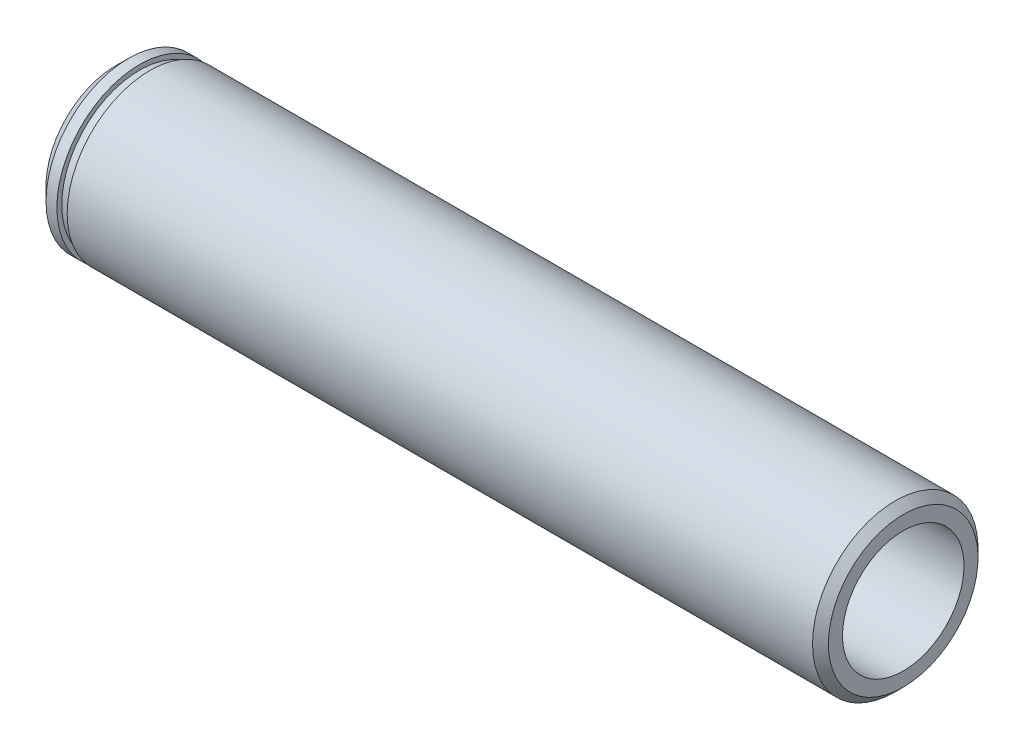
ISO-10303-21;
HEADER;
FILE_DESCRIPTION(('STEP AP214'),'2;1');
FILE_NAME('part.step','',(''),(''),'','','');
FILE_SCHEMA(('AUTOMOTIVE_DESIGN { 1 0 10303 214 1 1 1 1 }'));
ENDSEC;
DATA;
#1=APPLICATION_CONTEXT('core data for automotive mechanical design processes');
#2=APPLICATION_PROTOCOL_DEFINITION('international standard','automotive_design',2000,#1);
#3=PRODUCT_CONTEXT('',#1,'mechanical');
#4=PRODUCT('Part','Part','',(#3));
#5=PRODUCT_RELATED_PRODUCT_CATEGORY('part','',(#4));
#6=PRODUCT_DEFINITION_FORMATION('','',#4);
#7=PRODUCT_DEFINITION_CONTEXT('part definition',#1,'design');
#8=PRODUCT_DEFINITION('design','',#6,#7);
#9=PRODUCT_DEFINITION_SHAPE('','',#8);
#10=(LENGTH_UNIT() NAMED_UNIT(*) SI_UNIT(.MILLI.,.METRE.));
#11=(NAMED_UNIT(*) PLANE_ANGLE_UNIT() SI_UNIT($,.RADIAN.));
#12=(NAMED_UNIT(*) SI_UNIT($,.STERADIAN.) SOLID_ANGLE_UNIT());
#13=UNCERTAINTY_MEASURE_WITH_UNIT(LENGTH_MEASURE(1.E-05),#10,'distance_accuracy_value','');
#14=(GEOMETRIC_REPRESENTATION_CONTEXT(3) GLOBAL_UNCERTAINTY_ASSIGNED_CONTEXT((#13)) GLOBAL_UNIT_ASSIGNED_CONTEXT((#10,
#11,#12)) REPRESENTATION_CONTEXT('',''));
#15=CARTESIAN_POINT('',(0.,0.,0.));
#16=DIRECTION('',(0.,0.,1.));
#17=DIRECTION('',(1.,0.,0.));
#18=AXIS2_PLACEMENT_3D('',#15,#16,#17);
#19=CARTESIAN_POINT('',(0.,0.,0.));
#20=DIRECTION('',(-1.,0.,0.));
#21=DIRECTION('',(0.,0.,1.));
#22=AXIS2_PLACEMENT_3D('',#19,#20,#21);
#23=PLANE('',#22);
#24=CARTESIAN_POINT('',(0.,0.,0.));
#25=DIRECTION('',(-1.,0.,0.));
#26=DIRECTION('',(0.,0.,1.));
#27=AXIS2_PLACEMENT_3D('',#24,#25,#26);
#28=CIRCLE('',#27,5.9944);
#29=CARTESIAN_POINT('',(0.,0.,5.9944));
#30=VERTEX_POINT('',#29);
#31=EDGE_CURVE('E38',#30,#30,#28,.F.);
#32=ORIENTED_EDGE('',*,*,#31,.T.);
#33=EDGE_LOOP('',(#32));
#34=FACE_BOUND('',#33,.T.);
#35=CARTESIAN_POINT('',(-4.75314232417645E-13,0.,0.));
#36=DIRECTION('',(1.,0.,0.));
#37=DIRECTION('',(0.,0.,-1.));
#38=AXIS2_PLACEMENT_3D('',#35,#36,#37);
#39=CIRCLE('',#38,6.66750000000047);
#40=CARTESIAN_POINT('',(-4.75314232417645E-13,0.,-6.66750000000047));
#41=VERTEX_POINT('',#40);
#42=EDGE_CURVE('E20',#41,#41,#39,.T.);
#43=ORIENTED_EDGE('',*,*,#42,.F.);
#44=EDGE_LOOP('',(#43));
#45=FACE_BOUND('',#44,.T.);
#46=ADVANCED_FACE('F17',(#34,#45),#23,.T.);
#47=CARTESIAN_POINT('',(1.26999999999971,0.,0.));
#48=DIRECTION('',(1.,0.,0.));
#49=DIRECTION('',(0.,0.,-1.));
#50=AXIS2_PLACEMENT_3D('',#47,#48,#49);
#51=CONICAL_SURFACE('',#50,7.93750000000029,0.7853981633973);
#52=CARTESIAN_POINT('',(1.26999999999999,0.,0.));
#53=DIRECTION('',(-1.,0.,0.));
#54=DIRECTION('',(0.,0.,1.));
#55=AXIS2_PLACEMENT_3D('',#52,#53,#54);
#56=CIRCLE('',#55,7.9375);
#57=CARTESIAN_POINT('',(1.26999999999999,0.,7.9375));
#58=VERTEX_POINT('',#57);
#59=EDGE_CURVE('E34',#58,#58,#56,.F.);
#60=ORIENTED_EDGE('',*,*,#59,.F.);
#61=EDGE_LOOP('',(#60));
#62=FACE_BOUND('',#61,.T.);
#63=ORIENTED_EDGE('',*,*,#42,.T.);
#64=EDGE_LOOP('',(#63));
#65=FACE_BOUND('',#64,.T.);
#66=ADVANCED_FACE('F67',(#62,#65),#51,.T.);
#67=CARTESIAN_POINT('',(79.34325,0.,0.));
#68=DIRECTION('',(-1.,0.,0.));
#69=DIRECTION('',(0.,0.,1.));
#70=AXIS2_PLACEMENT_3D('',#67,#68,#69);
#71=CYLINDRICAL_SURFACE('',#70,5.9944);
#72=CARTESIAN_POINT('',(8.89,0.,0.));
#73=DIRECTION('',(-1.,0.,0.));
#74=DIRECTION('',(0.,0.,1.));
#75=AXIS2_PLACEMENT_3D('',#72,#73,#74);
#76=CIRCLE('',#75,5.9944);
#77=CARTESIAN_POINT('',(8.89,0.,5.9944));
#78=VERTEX_POINT('',#77);
#79=EDGE_CURVE('E37',#78,#78,#76,.T.);
#80=ORIENTED_EDGE('',*,*,#79,.F.);
#81=EDGE_LOOP('',(#80));
#82=FACE_BOUND('',#81,.T.);
#83=ORIENTED_EDGE('',*,*,#31,.F.);
#84=EDGE_LOOP('',(#83));
#85=FACE_BOUND('',#84,.T.);
#86=ADVANCED_FACE('F74',(#82,#85),#71,.F.);
#87=CARTESIAN_POINT('',(79.34325,0.,0.));
#88=DIRECTION('',(-1.,0.,0.));
#89=DIRECTION('',(0.,0.,1.));
#90=AXIS2_PLACEMENT_3D('',#87,#88,#89);
#91=CYLINDRICAL_SURFACE('',#90,7.9375);
#92=CARTESIAN_POINT('',(2.31140000000001,0.,0.));
#93=DIRECTION('',(-1.,0.,0.));
#94=DIRECTION('',(0.,0.,1.));
#95=AXIS2_PLACEMENT_3D('',#92,#93,#94);
#96=CIRCLE('',#95,7.9375);
#97=CARTESIAN_POINT('',(2.31140000000001,0.,7.9375));
#98=VERTEX_POINT('',#97);
#99=EDGE_CURVE('E53',#98,#98,#96,.T.);
#100=ORIENTED_EDGE('',*,*,#99,.T.);
#101=EDGE_LOOP('',(#100));
#102=FACE_BOUND('',#101,.T.);
#103=ORIENTED_EDGE('',*,*,#59,.T.);
#104=EDGE_LOOP('',(#103));
#105=FACE_BOUND('',#104,.T.);
#106=ADVANCED_FACE('F110',(#102,#105),#91,.T.);
#107=CARTESIAN_POINT('',(8.89,0.,0.));
#108=DIRECTION('',(-1.,0.,0.));
#109=DIRECTION('',(0.,0.,1.));
#110=AXIS2_PLACEMENT_3D('',#107,#108,#109);
#111=PLANE('',#110);
#112=CARTESIAN_POINT('',(8.89,0.,0.));
#113=DIRECTION('',(-1.,0.,0.));
#114=DIRECTION('',(0.,0.,1.));
#115=AXIS2_PLACEMENT_3D('',#112,#113,#114);
#116=CIRCLE('',#115,5.8293);
#117=CARTESIAN_POINT('',(8.89,0.,5.8293));
#118=VERTEX_POINT('',#117);
#119=EDGE_CURVE('E204',#118,#118,#116,.F.);
#120=ORIENTED_EDGE('',*,*,#119,.T.);
#121=EDGE_LOOP('',(#120));
#122=FACE_BOUND('',#121,.T.);
#123=ORIENTED_EDGE('',*,*,#79,.T.);
#124=EDGE_LOOP('',(#123));
#125=FACE_BOUND('',#124,.T.);
#126=ADVANCED_FACE('F106',(#122,#125),#111,.T.);
#127=CARTESIAN_POINT('',(2.3114,0.,0.));
#128=DIRECTION('',(-1.,0.,0.));
#129=DIRECTION('',(0.,0.,1.));
#130=AXIS2_PLACEMENT_3D('',#127,#128,#129);
#131=PLANE('',#130);
#132=CARTESIAN_POINT('',(2.31140000000001,0.,0.));
#133=DIRECTION('',(-1.,0.,0.));
#134=DIRECTION('',(0.,0.,1.));
#135=AXIS2_PLACEMENT_3D('',#132,#133,#134);
#136=CIRCLE('',#135,7.4676);
#137=CARTESIAN_POINT('',(2.31140000000001,0.,7.4676));
#138=VERTEX_POINT('',#137);
#139=EDGE_CURVE('E207',#138,#138,#136,.F.);
#140=ORIENTED_EDGE('',*,*,#139,.F.);
#141=EDGE_LOOP('',(#140));
#142=FACE_BOUND('',#141,.T.);
#143=ORIENTED_EDGE('',*,*,#99,.F.);
#144=EDGE_LOOP('',(#143));
#145=FACE_BOUND('',#144,.T.);
#146=ADVANCED_FACE('F102',(#142,#145),#131,.F.);
#147=CARTESIAN_POINT('',(79.34325,0.,0.));
#148=DIRECTION('',(-1.,0.,0.));
#149=DIRECTION('',(0.,0.,1.));
#150=AXIS2_PLACEMENT_3D('',#147,#148,#149);
#151=CYLINDRICAL_SURFACE('',#150,5.8293);
#152=ORIENTED_EDGE('',*,*,#119,.F.);
#153=EDGE_LOOP('',(#152));
#154=FACE_BOUND('',#153,.T.);
#155=CARTESIAN_POINT('',(75.565,0.,0.));
#156=DIRECTION('',(-1.,0.,0.));
#157=DIRECTION('',(0.,0.,1.));
#158=AXIS2_PLACEMENT_3D('',#155,#156,#157);
#159=CIRCLE('',#158,5.8293);
#160=CARTESIAN_POINT('',(75.565,0.,5.8293));
#161=VERTEX_POINT('',#160);
#162=EDGE_CURVE('E210',#161,#161,#159,.F.);
#163=ORIENTED_EDGE('',*,*,#162,.T.);
#164=EDGE_LOOP('',(#163));
#165=FACE_BOUND('',#164,.T.);
#166=ADVANCED_FACE('F98',(#154,#165),#151,.F.);
#167=CARTESIAN_POINT('',(79.34325,0.,0.));
#168=DIRECTION('',(-1.,0.,0.));
#169=DIRECTION('',(0.,0.,1.));
#170=AXIS2_PLACEMENT_3D('',#167,#168,#169);
#171=CYLINDRICAL_SURFACE('',#170,7.4676);
#172=CARTESIAN_POINT('',(3.302,0.,0.));
#173=DIRECTION('',(-1.,0.,0.));
#174=DIRECTION('',(0.,0.,1.));
#175=AXIS2_PLACEMENT_3D('',#172,#173,#174);
#176=CIRCLE('',#175,7.4676);
#177=CARTESIAN_POINT('',(3.302,0.,7.4676));
#178=VERTEX_POINT('',#177);
#179=EDGE_CURVE('E43',#178,#178,#176,.F.);
#180=ORIENTED_EDGE('',*,*,#179,.F.);
#181=EDGE_LOOP('',(#180));
#182=FACE_BOUND('',#181,.T.);
#183=ORIENTED_EDGE('',*,*,#139,.T.);
#184=EDGE_LOOP('',(#183));
#185=FACE_BOUND('',#184,.T.);
#186=ADVANCED_FACE('F94',(#182,#185),#171,.T.);
#187=CARTESIAN_POINT('',(75.565,0.,0.));
#188=DIRECTION('',(-1.,0.,0.));
#189=DIRECTION('',(0.,0.,1.));
#190=AXIS2_PLACEMENT_3D('',#187,#188,#189);
#191=PLANE('',#190);
#192=ORIENTED_EDGE('',*,*,#162,.F.);
#193=EDGE_LOOP('',(#192));
#194=FACE_BOUND('',#193,.T.);
#195=CARTESIAN_POINT('',(75.5649999999988,0.,0.));
#196=DIRECTION('',(-1.,0.,0.));
#197=DIRECTION('',(0.,-1.,0.));
#198=AXIS2_PLACEMENT_3D('',#195,#196,#197);
#199=CIRCLE('',#198,7.17549999999879);
#200=CARTESIAN_POINT('',(75.5649999999988,-7.17549999999879,0.));
#201=VERTEX_POINT('',#200);
#202=EDGE_CURVE('E30',#201,#201,#199,.T.);
#203=ORIENTED_EDGE('',*,*,#202,.F.);
#204=EDGE_LOOP('',(#203));
#205=FACE_BOUND('',#204,.T.);
#206=ADVANCED_FACE('F90',(#194,#205),#191,.F.);
#207=CARTESIAN_POINT('',(3.302,0.,0.));
#208=DIRECTION('',(-1.,0.,0.));
#209=DIRECTION('',(0.,0.,1.));
#210=AXIS2_PLACEMENT_3D('',#207,#208,#209);
#211=PLANE('',#210);
#212=ORIENTED_EDGE('',*,*,#179,.T.);
#213=EDGE_LOOP('',(#212));
#214=FACE_BOUND('',#213,.T.);
#215=CARTESIAN_POINT('',(3.302,0.,0.));
#216=DIRECTION('',(-1.,0.,0.));
#217=DIRECTION('',(0.,0.,1.));
#218=AXIS2_PLACEMENT_3D('',#215,#216,#217);
#219=CIRCLE('',#218,7.9375);
#220=CARTESIAN_POINT('',(3.302,0.,7.9375));
#221=VERTEX_POINT('',#220);
#222=EDGE_CURVE('E25',#221,#221,#219,.F.);
#223=ORIENTED_EDGE('',*,*,#222,.F.);
#224=EDGE_LOOP('',(#223));
#225=FACE_BOUND('',#224,.T.);
#226=ADVANCED_FACE('F84',(#214,#225),#211,.T.);
#227=CARTESIAN_POINT('',(74.8029999999987,0.,0.));
#228=DIRECTION('',(-1.,0.,0.));
#229=DIRECTION('',(0.,-1.,0.));
#230=AXIS2_PLACEMENT_3D('',#227,#228,#229);
#231=CONICAL_SURFACE('',#230,7.93749999999867,0.7853981633973);
#232=ORIENTED_EDGE('',*,*,#202,.T.);
#233=EDGE_LOOP('',(#232));
#234=FACE_BOUND('',#233,.T.);
#235=CARTESIAN_POINT('',(74.803,0.,0.));
#236=DIRECTION('',(-1.,0.,0.));
#237=DIRECTION('',(0.,0.,1.));
#238=AXIS2_PLACEMENT_3D('',#235,#236,#237);
#239=CIRCLE('',#238,7.9375);
#240=CARTESIAN_POINT('',(74.803,0.,7.9375));
#241=VERTEX_POINT('',#240);
#242=EDGE_CURVE('E11',#241,#241,#239,.T.);
#243=ORIENTED_EDGE('',*,*,#242,.F.);
#244=EDGE_LOOP('',(#243));
#245=FACE_BOUND('',#244,.T.);
#246=ADVANCED_FACE('F78',(#234,#245),#231,.T.);
#247=CARTESIAN_POINT('',(79.34325,0.,0.));
#248=DIRECTION('',(-1.,0.,0.));
#249=DIRECTION('',(0.,0.,1.));
#250=AXIS2_PLACEMENT_3D('',#247,#248,#249);
#251=CYLINDRICAL_SURFACE('',#250,7.9375);
#252=ORIENTED_EDGE('',*,*,#222,.T.);
#253=EDGE_LOOP('',(#252));
#254=FACE_BOUND('',#253,.T.);
#255=ORIENTED_EDGE('',*,*,#242,.T.);
#256=EDGE_LOOP('',(#255));
#257=FACE_BOUND('',#256,.T.);
#258=ADVANCED_FACE('F76',(#254,#257),#251,.T.);
#259=CLOSED_SHELL('',(#46,#66,#86,#106,#126,#146,#166,#186,#206,#226,#246,#258));
#260=MANIFOLD_SOLID_BREP('B1',#259);
#261=ADVANCED_BREP_SHAPE_REPRESENTATION('',(#18,#260),#14);
#262=SHAPE_DEFINITION_REPRESENTATION(#9,#261);
ENDSEC;
END-ISO-10303-21;
